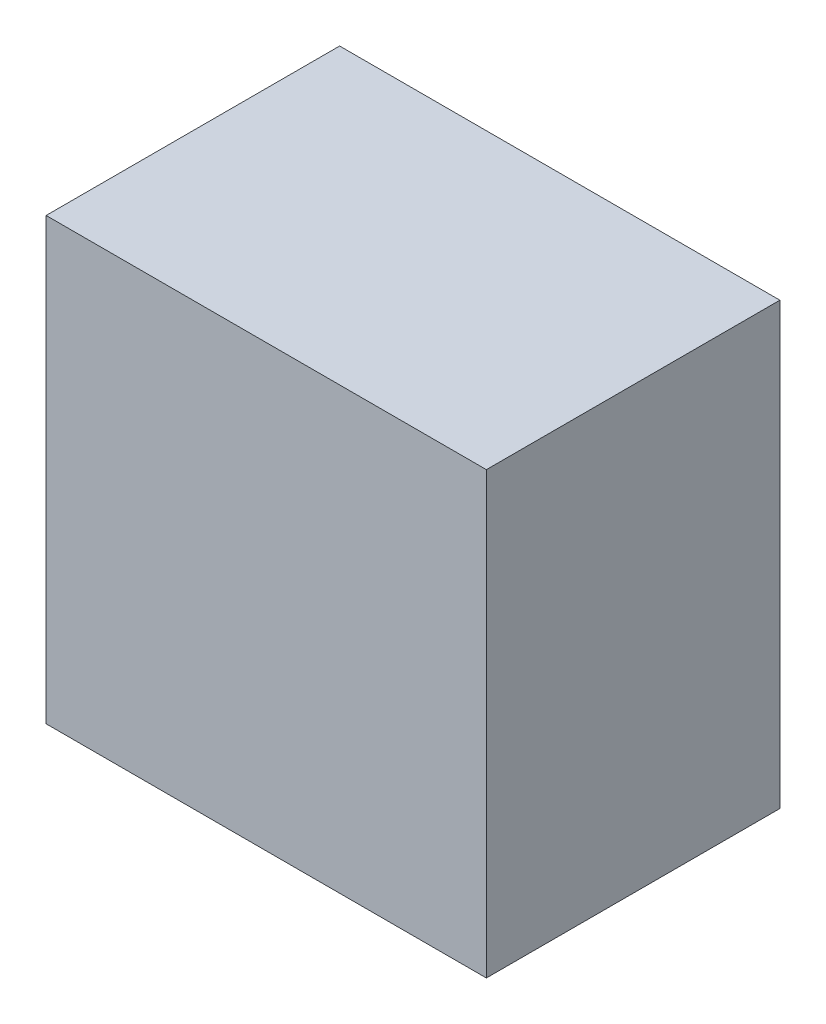
ISO-10303-21;
HEADER;
FILE_DESCRIPTION(('STEP AP214'),'2;1');
FILE_NAME('part.step','',(''),(''),'','','');
FILE_SCHEMA(('AUTOMOTIVE_DESIGN { 1 0 10303 214 1 1 1 1 }'));
ENDSEC;
DATA;
#1=APPLICATION_CONTEXT('core data for automotive mechanical design processes');
#2=APPLICATION_PROTOCOL_DEFINITION('international standard','automotive_design',2000,#1);
#3=PRODUCT_CONTEXT('',#1,'mechanical');
#4=PRODUCT('Part','Part','',(#3));
#5=PRODUCT_RELATED_PRODUCT_CATEGORY('part','',(#4));
#6=PRODUCT_DEFINITION_FORMATION('','',#4);
#7=PRODUCT_DEFINITION_CONTEXT('part definition',#1,'design');
#8=PRODUCT_DEFINITION('design','',#6,#7);
#9=PRODUCT_DEFINITION_SHAPE('','',#8);
#10=(LENGTH_UNIT() NAMED_UNIT(*) SI_UNIT(.MILLI.,.METRE.));
#11=(NAMED_UNIT(*) PLANE_ANGLE_UNIT() SI_UNIT($,.RADIAN.));
#12=(NAMED_UNIT(*) SI_UNIT($,.STERADIAN.) SOLID_ANGLE_UNIT());
#13=UNCERTAINTY_MEASURE_WITH_UNIT(LENGTH_MEASURE(1.E-05),#10,'distance_accuracy_value','');
#14=(GEOMETRIC_REPRESENTATION_CONTEXT(3) GLOBAL_UNCERTAINTY_ASSIGNED_CONTEXT((#13)) GLOBAL_UNIT_ASSIGNED_CONTEXT((#10,
#11,#12)) REPRESENTATION_CONTEXT('',''));
#15=CARTESIAN_POINT('',(0.,0.,0.));
#16=DIRECTION('',(0.,0.,1.));
#17=DIRECTION('',(1.,0.,0.));
#18=AXIS2_PLACEMENT_3D('',#15,#16,#17);
#19=CARTESIAN_POINT('',(-15.,15.,20.));
#20=DIRECTION('',(0.,1.,0.));
#21=DIRECTION('',(0.,0.,1.));
#22=AXIS2_PLACEMENT_3D('',#19,#20,#21);
#23=PLANE('',#22);
#24=DIRECTION('',(1.,0.,0.));
#25=VECTOR('',#24,1.);
#26=CARTESIAN_POINT('',(-15.,15.,0.));
#27=LINE('',#26,#25);
#28=CARTESIAN_POINT('',(-15.,15.,0.));
#29=VERTEX_POINT('',#28);
#30=CARTESIAN_POINT('',(15.,15.,0.));
#31=VERTEX_POINT('',#30);
#32=EDGE_CURVE('E110',#29,#31,#27,.T.);
#33=ORIENTED_EDGE('',*,*,#32,.F.);
#34=DIRECTION('',(0.,0.,-1.));
#35=VECTOR('',#34,1.);
#36=CARTESIAN_POINT('',(-15.,15.,20.));
#37=LINE('',#36,#35);
#38=CARTESIAN_POINT('',(-15.,15.,20.));
#39=VERTEX_POINT('',#38);
#40=EDGE_CURVE('E11',#39,#29,#37,.T.);
#41=ORIENTED_EDGE('',*,*,#40,.F.);
#42=DIRECTION('',(1.,0.,0.));
#43=VECTOR('',#42,1.);
#44=CARTESIAN_POINT('',(-15.,15.,20.));
#45=LINE('',#44,#43);
#46=CARTESIAN_POINT('',(15.,15.,20.));
#47=VERTEX_POINT('',#46);
#48=EDGE_CURVE('E103',#39,#47,#45,.T.);
#49=ORIENTED_EDGE('',*,*,#48,.T.);
#50=DIRECTION('',(0.,0.,-1.));
#51=VECTOR('',#50,1.);
#52=CARTESIAN_POINT('',(15.,15.,20.));
#53=LINE('',#52,#51);
#54=EDGE_CURVE('E42',#47,#31,#53,.T.);
#55=ORIENTED_EDGE('',*,*,#54,.T.);
#56=EDGE_LOOP('',(#33,#41,#49,#55));
#57=FACE_BOUND('',#56,.T.);
#58=ADVANCED_FACE('F39',(#57),#23,.T.);
#59=CARTESIAN_POINT('',(-15.,15.,20.));
#60=DIRECTION('',(1.,0.,0.));
#61=DIRECTION('',(0.,1.,0.));
#62=AXIS2_PLACEMENT_3D('',#59,#60,#61);
#63=PLANE('',#62);
#64=DIRECTION('',(0.,-1.,0.));
#65=VECTOR('',#64,1.);
#66=CARTESIAN_POINT('',(-15.,15.,0.));
#67=LINE('',#66,#65);
#68=CARTESIAN_POINT('',(-15.,-15.,0.));
#69=VERTEX_POINT('',#68);
#70=EDGE_CURVE('E73',#29,#69,#67,.T.);
#71=ORIENTED_EDGE('',*,*,#70,.T.);
#72=DIRECTION('',(0.,0.,-1.));
#73=VECTOR('',#72,1.);
#74=CARTESIAN_POINT('',(-15.,-15.,20.));
#75=LINE('',#74,#73);
#76=CARTESIAN_POINT('',(-15.,-15.,20.));
#77=VERTEX_POINT('',#76);
#78=EDGE_CURVE('E49',#77,#69,#75,.T.);
#79=ORIENTED_EDGE('',*,*,#78,.F.);
#80=DIRECTION('',(0.,-1.,0.));
#81=VECTOR('',#80,1.);
#82=CARTESIAN_POINT('',(-15.,15.,20.));
#83=LINE('',#82,#81);
#84=EDGE_CURVE('E90',#39,#77,#83,.T.);
#85=ORIENTED_EDGE('',*,*,#84,.F.);
#86=ORIENTED_EDGE('',*,*,#40,.T.);
#87=EDGE_LOOP('',(#71,#79,#85,#86));
#88=FACE_BOUND('',#87,.T.);
#89=ADVANCED_FACE('F126',(#88),#63,.F.);
#90=CARTESIAN_POINT('',(-15.,-15.,20.));
#91=DIRECTION('',(0.,1.,0.));
#92=DIRECTION('',(0.,0.,1.));
#93=AXIS2_PLACEMENT_3D('',#90,#91,#92);
#94=PLANE('',#93);
#95=DIRECTION('',(1.,0.,0.));
#96=VECTOR('',#95,1.);
#97=CARTESIAN_POINT('',(-15.,-15.,0.));
#98=LINE('',#97,#96);
#99=CARTESIAN_POINT('',(15.,-15.,0.));
#100=VERTEX_POINT('',#99);
#101=EDGE_CURVE('E98',#69,#100,#98,.T.);
#102=ORIENTED_EDGE('',*,*,#101,.T.);
#103=DIRECTION('',(0.,0.,-1.));
#104=VECTOR('',#103,1.);
#105=CARTESIAN_POINT('',(15.,-15.,20.));
#106=LINE('',#105,#104);
#107=CARTESIAN_POINT('',(15.,-15.,20.));
#108=VERTEX_POINT('',#107);
#109=EDGE_CURVE('E95',#108,#100,#106,.T.);
#110=ORIENTED_EDGE('',*,*,#109,.F.);
#111=DIRECTION('',(1.,0.,0.));
#112=VECTOR('',#111,1.);
#113=CARTESIAN_POINT('',(-15.,-15.,20.));
#114=LINE('',#113,#112);
#115=EDGE_CURVE('E85',#77,#108,#114,.T.);
#116=ORIENTED_EDGE('',*,*,#115,.F.);
#117=ORIENTED_EDGE('',*,*,#78,.T.);
#118=EDGE_LOOP('',(#102,#110,#116,#117));
#119=FACE_BOUND('',#118,.T.);
#120=ADVANCED_FACE('F96',(#119),#94,.F.);
#121=CARTESIAN_POINT('',(15.,15.,20.));
#122=DIRECTION('',(1.,0.,0.));
#123=DIRECTION('',(0.,1.,0.));
#124=AXIS2_PLACEMENT_3D('',#121,#122,#123);
#125=PLANE('',#124);
#126=DIRECTION('',(0.,-1.,0.));
#127=VECTOR('',#126,1.);
#128=CARTESIAN_POINT('',(15.,15.,0.));
#129=LINE('',#128,#127);
#130=EDGE_CURVE('E114',#31,#100,#129,.T.);
#131=ORIENTED_EDGE('',*,*,#130,.F.);
#132=ORIENTED_EDGE('',*,*,#54,.F.);
#133=DIRECTION('',(0.,-1.,0.));
#134=VECTOR('',#133,1.);
#135=CARTESIAN_POINT('',(15.,15.,20.));
#136=LINE('',#135,#134);
#137=EDGE_CURVE('E89',#47,#108,#136,.T.);
#138=ORIENTED_EDGE('',*,*,#137,.T.);
#139=ORIENTED_EDGE('',*,*,#109,.T.);
#140=EDGE_LOOP('',(#131,#132,#138,#139));
#141=FACE_BOUND('',#140,.T.);
#142=ADVANCED_FACE('F101',(#141),#125,.T.);
#143=CARTESIAN_POINT('',(0.,0.,20.));
#144=DIRECTION('',(0.,0.,-1.));
#145=DIRECTION('',(-1.,0.,0.));
#146=AXIS2_PLACEMENT_3D('',#143,#144,#145);
#147=PLANE('',#146);
#148=ORIENTED_EDGE('',*,*,#48,.F.);
#149=ORIENTED_EDGE('',*,*,#84,.T.);
#150=ORIENTED_EDGE('',*,*,#115,.T.);
#151=ORIENTED_EDGE('',*,*,#137,.F.);
#152=EDGE_LOOP('',(#148,#149,#150,#151));
#153=FACE_BOUND('',#152,.T.);
#154=ADVANCED_FACE('F88',(#153),#147,.F.);
#155=CARTESIAN_POINT('',(0.,0.,0.));
#156=DIRECTION('',(0.,0.,-1.));
#157=DIRECTION('',(-1.,0.,0.));
#158=AXIS2_PLACEMENT_3D('',#155,#156,#157);
#159=PLANE('',#158);
#160=ORIENTED_EDGE('',*,*,#32,.T.);
#161=ORIENTED_EDGE('',*,*,#130,.T.);
#162=ORIENTED_EDGE('',*,*,#101,.F.);
#163=ORIENTED_EDGE('',*,*,#70,.F.);
#164=EDGE_LOOP('',(#160,#161,#162,#163));
#165=FACE_BOUND('',#164,.T.);
#166=ADVANCED_FACE('F123',(#165),#159,.T.);
#167=CLOSED_SHELL('',(#58,#89,#120,#142,#154,#166));
#168=MANIFOLD_SOLID_BREP('B2',#167);
#169=ADVANCED_BREP_SHAPE_REPRESENTATION('',(#18,#168),#14);
#170=SHAPE_DEFINITION_REPRESENTATION(#9,#169);
ENDSEC;
END-ISO-10303-21;
